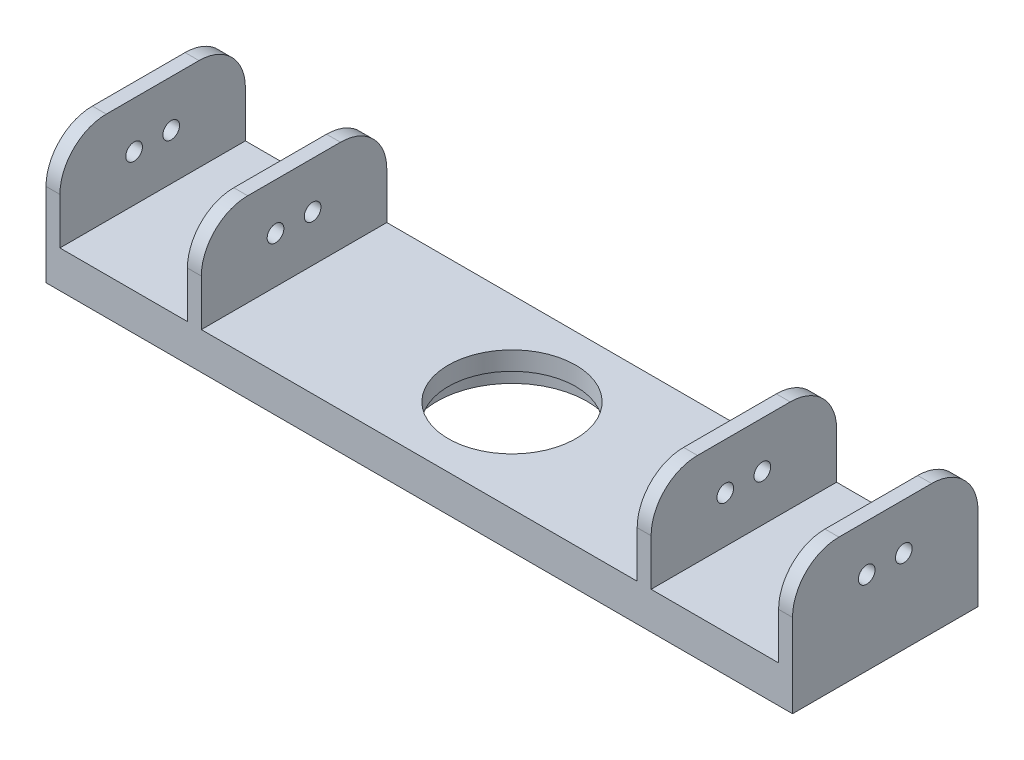
ISO-10303-21;
HEADER;
FILE_DESCRIPTION(('STEP AP214'),'2;1');
FILE_NAME('part.step','',(''),(''),'','','');
FILE_SCHEMA(('AUTOMOTIVE_DESIGN { 1 0 10303 214 1 1 1 1 }'));
ENDSEC;
DATA;
#1=APPLICATION_CONTEXT('core data for automotive mechanical design processes');
#2=APPLICATION_PROTOCOL_DEFINITION('international standard','automotive_design',2000,#1);
#3=PRODUCT_CONTEXT('',#1,'mechanical');
#4=PRODUCT('Part','Part','',(#3));
#5=PRODUCT_RELATED_PRODUCT_CATEGORY('part','',(#4));
#6=PRODUCT_DEFINITION_FORMATION('','',#4);
#7=PRODUCT_DEFINITION_CONTEXT('part definition',#1,'design');
#8=PRODUCT_DEFINITION('design','',#6,#7);
#9=PRODUCT_DEFINITION_SHAPE('','',#8);
#10=(LENGTH_UNIT() NAMED_UNIT(*) SI_UNIT(.MILLI.,.METRE.));
#11=(NAMED_UNIT(*) PLANE_ANGLE_UNIT() SI_UNIT($,.RADIAN.));
#12=(NAMED_UNIT(*) SI_UNIT($,.STERADIAN.) SOLID_ANGLE_UNIT());
#13=UNCERTAINTY_MEASURE_WITH_UNIT(LENGTH_MEASURE(1.E-05),#10,'distance_accuracy_value','');
#14=(GEOMETRIC_REPRESENTATION_CONTEXT(3) GLOBAL_UNCERTAINTY_ASSIGNED_CONTEXT((#13)) GLOBAL_UNIT_ASSIGNED_CONTEXT((#10,
#11,#12)) REPRESENTATION_CONTEXT('',''));
#15=CARTESIAN_POINT('',(0.,0.,0.));
#16=DIRECTION('',(0.,0.,1.));
#17=DIRECTION('',(1.,0.,0.));
#18=AXIS2_PLACEMENT_3D('',#15,#16,#17);
#19=CARTESIAN_POINT('',(0.,8.,0.));
#20=DIRECTION('',(0.,-1.,0.));
#21=DIRECTION('',(0.,0.,-1.));
#22=AXIS2_PLACEMENT_3D('',#19,#20,#21);
#23=PLANE('',#22);
#24=DIRECTION('',(0.,0.,-1.));
#25=VECTOR('',#24,1.);
#26=CARTESIAN_POINT('',(50.,8.,-20.));
#27=LINE('',#26,#25);
#28=CARTESIAN_POINT('',(50.,8.,20.));
#29=VERTEX_POINT('',#28);
#30=CARTESIAN_POINT('',(50.,8.,-20.));
#31=VERTEX_POINT('',#30);
#32=EDGE_CURVE('E199',#29,#31,#27,.T.);
#33=ORIENTED_EDGE('',*,*,#32,.F.);
#34=DIRECTION('',(1.,0.,0.));
#35=VECTOR('',#34,1.);
#36=CARTESIAN_POINT('',(-80.5,8.,20.));
#37=LINE('',#36,#35);
#38=CARTESIAN_POINT('',(77.5,8.,20.));
#39=VERTEX_POINT('',#38);
#40=EDGE_CURVE('E208',#29,#39,#37,.T.);
#41=ORIENTED_EDGE('',*,*,#40,.T.);
#42=DIRECTION('',(0.,0.,1.));
#43=VECTOR('',#42,1.);
#44=CARTESIAN_POINT('',(77.5,8.,-20.));
#45=LINE('',#44,#43);
#46=CARTESIAN_POINT('',(77.5,8.,-20.));
#47=VERTEX_POINT('',#46);
#48=EDGE_CURVE('E238',#47,#39,#45,.T.);
#49=ORIENTED_EDGE('',*,*,#48,.F.);
#50=DIRECTION('',(-1.,0.,0.));
#51=VECTOR('',#50,1.);
#52=CARTESIAN_POINT('',(-80.5,8.,-20.));
#53=LINE('',#52,#51);
#54=EDGE_CURVE('E216',#47,#31,#53,.T.);
#55=ORIENTED_EDGE('',*,*,#54,.T.);
#56=EDGE_LOOP('',(#33,#41,#49,#55));
#57=FACE_BOUND('',#56,.T.);
#58=ADVANCED_FACE('F33',(#57),#23,.F.);
#59=CARTESIAN_POINT('',(0.,8.,0.));
#60=DIRECTION('',(0.,-1.,0.));
#61=DIRECTION('',(0.,0.,-1.));
#62=AXIS2_PLACEMENT_3D('',#59,#60,#61);
#63=CIRCLE('',#62,13.75);
#64=CARTESIAN_POINT('',(0.,8.,-13.75));
#65=VERTEX_POINT('',#64);
#66=EDGE_CURVE('E898',#65,#65,#63,.F.);
#67=ORIENTED_EDGE('',*,*,#66,.F.);
#68=EDGE_LOOP('',(#67));
#69=FACE_BOUND('',#68,.T.);
#70=DIRECTION('',(0.,0.,1.));
#71=VECTOR('',#70,1.);
#72=CARTESIAN_POINT('',(47.,8.,-20.));
#73=LINE('',#72,#71);
#74=CARTESIAN_POINT('',(47.,8.,-20.));
#75=VERTEX_POINT('',#74);
#76=CARTESIAN_POINT('',(47.,8.,20.));
#77=VERTEX_POINT('',#76);
#78=EDGE_CURVE('E221',#75,#77,#73,.T.);
#79=ORIENTED_EDGE('',*,*,#78,.F.);
#80=CARTESIAN_POINT('',(-47.,8.,-20.));
#81=VERTEX_POINT('',#80);
#82=EDGE_CURVE('E282',#75,#81,#53,.T.);
#83=ORIENTED_EDGE('',*,*,#82,.T.);
#84=DIRECTION('',(0.,0.,-1.));
#85=VECTOR('',#84,1.);
#86=CARTESIAN_POINT('',(-47.,8.,-20.));
#87=LINE('',#86,#85);
#88=CARTESIAN_POINT('',(-47.,8.,20.));
#89=VERTEX_POINT('',#88);
#90=EDGE_CURVE('E266',#89,#81,#87,.T.);
#91=ORIENTED_EDGE('',*,*,#90,.F.);
#92=EDGE_CURVE('E215',#89,#77,#37,.T.);
#93=ORIENTED_EDGE('',*,*,#92,.T.);
#94=EDGE_LOOP('',(#79,#83,#91,#93));
#95=FACE_BOUND('',#94,.T.);
#96=ADVANCED_FACE('F436',(#69,#95),#23,.F.);
#97=DIRECTION('',(0.,0.,-1.));
#98=VECTOR('',#97,1.);
#99=CARTESIAN_POINT('',(-77.5,8.,-20.));
#100=LINE('',#99,#98);
#101=CARTESIAN_POINT('',(-77.5,8.,20.));
#102=VERTEX_POINT('',#101);
#103=CARTESIAN_POINT('',(-77.5,8.,-20.));
#104=VERTEX_POINT('',#103);
#105=EDGE_CURVE('E248',#102,#104,#100,.T.);
#106=ORIENTED_EDGE('',*,*,#105,.F.);
#107=CARTESIAN_POINT('',(-50.,8.,20.));
#108=VERTEX_POINT('',#107);
#109=EDGE_CURVE('E218',#102,#108,#37,.T.);
#110=ORIENTED_EDGE('',*,*,#109,.T.);
#111=DIRECTION('',(0.,0.,1.));
#112=VECTOR('',#111,1.);
#113=CARTESIAN_POINT('',(-50.,8.,-20.));
#114=LINE('',#113,#112);
#115=CARTESIAN_POINT('',(-50.,8.,-20.));
#116=VERTEX_POINT('',#115);
#117=EDGE_CURVE('E261',#116,#108,#114,.T.);
#118=ORIENTED_EDGE('',*,*,#117,.F.);
#119=EDGE_CURVE('E283',#116,#104,#53,.T.);
#120=ORIENTED_EDGE('',*,*,#119,.T.);
#121=EDGE_LOOP('',(#106,#110,#118,#120));
#122=FACE_BOUND('',#121,.T.);
#123=ADVANCED_FACE('F429',(#122),#23,.F.);
#124=CARTESIAN_POINT('',(80.5,8.,20.));
#125=DIRECTION('',(-1.,0.,0.));
#126=DIRECTION('',(0.,0.,1.));
#127=AXIS2_PLACEMENT_3D('',#124,#125,#126);
#128=PLANE('',#127);
#129=CARTESIAN_POINT('',(80.5,18.,4.));
#130=DIRECTION('',(-1.,0.,0.));
#131=DIRECTION('',(0.,0.,1.));
#132=AXIS2_PLACEMENT_3D('',#129,#130,#131);
#133=CIRCLE('',#132,1.8);
#134=CARTESIAN_POINT('',(80.5,18.,5.8));
#135=VERTEX_POINT('',#134);
#136=EDGE_CURVE('E310',#135,#135,#133,.T.);
#137=ORIENTED_EDGE('',*,*,#136,.T.);
#138=EDGE_LOOP('',(#137));
#139=FACE_BOUND('',#138,.T.);
#140=CARTESIAN_POINT('',(80.5,18.,-4.));
#141=DIRECTION('',(-1.,0.,0.));
#142=DIRECTION('',(0.,0.,1.));
#143=AXIS2_PLACEMENT_3D('',#140,#141,#142);
#144=CIRCLE('',#143,1.8);
#145=CARTESIAN_POINT('',(80.5,18.,-2.2));
#146=VERTEX_POINT('',#145);
#147=EDGE_CURVE('E849',#146,#146,#144,.T.);
#148=ORIENTED_EDGE('',*,*,#147,.T.);
#149=EDGE_LOOP('',(#148));
#150=FACE_BOUND('',#149,.T.);
#151=DIRECTION('',(0.,0.,-1.));
#152=VECTOR('',#151,1.);
#153=CARTESIAN_POINT('',(80.5,28.,-20.));
#154=LINE('',#153,#152);
#155=CARTESIAN_POINT('',(80.5,28.,9.99999999999999));
#156=VERTEX_POINT('',#155);
#157=CARTESIAN_POINT('',(80.5,28.,-10.));
#158=VERTEX_POINT('',#157);
#159=EDGE_CURVE('E239',#156,#158,#154,.T.);
#160=ORIENTED_EDGE('',*,*,#159,.F.);
#161=CARTESIAN_POINT('',(80.5,18.,10.));
#162=DIRECTION('',(-1.,0.,0.));
#163=DIRECTION('',(0.,0.,1.));
#164=AXIS2_PLACEMENT_3D('',#161,#162,#163);
#165=CIRCLE('',#164,10.);
#166=CARTESIAN_POINT('',(80.5,18.,20.));
#167=VERTEX_POINT('',#166);
#168=EDGE_CURVE('E379',#156,#167,#165,.F.);
#169=ORIENTED_EDGE('',*,*,#168,.T.);
#170=DIRECTION('',(0.,-1.,0.));
#171=VECTOR('',#170,1.);
#172=CARTESIAN_POINT('',(80.5,8.,20.));
#173=LINE('',#172,#171);
#174=CARTESIAN_POINT('',(80.5,0.,20.));
#175=VERTEX_POINT('',#174);
#176=EDGE_CURVE('E286',#167,#175,#173,.T.);
#177=ORIENTED_EDGE('',*,*,#176,.T.);
#178=DIRECTION('',(0.,0.,-1.));
#179=VECTOR('',#178,1.);
#180=CARTESIAN_POINT('',(80.5,0.,20.));
#181=LINE('',#180,#179);
#182=CARTESIAN_POINT('',(80.5,0.,-20.));
#183=VERTEX_POINT('',#182);
#184=EDGE_CURVE('E281',#175,#183,#181,.T.);
#185=ORIENTED_EDGE('',*,*,#184,.T.);
#186=DIRECTION('',(0.,-1.,0.));
#187=VECTOR('',#186,1.);
#188=CARTESIAN_POINT('',(80.5,8.,-20.));
#189=LINE('',#188,#187);
#190=CARTESIAN_POINT('',(80.5,18.,-20.));
#191=VERTEX_POINT('',#190);
#192=EDGE_CURVE('E303',#191,#183,#189,.T.);
#193=ORIENTED_EDGE('',*,*,#192,.F.);
#194=CARTESIAN_POINT('',(80.5,18.,-10.));
#195=DIRECTION('',(-1.,0.,0.));
#196=DIRECTION('',(0.,0.,1.));
#197=AXIS2_PLACEMENT_3D('',#194,#195,#196);
#198=CIRCLE('',#197,10.);
#199=EDGE_CURVE('E377',#191,#158,#198,.F.);
#200=ORIENTED_EDGE('',*,*,#199,.T.);
#201=EDGE_LOOP('',(#160,#169,#177,#185,#193,#200));
#202=FACE_BOUND('',#201,.T.);
#203=ADVANCED_FACE('F389',(#139,#150,#202),#128,.F.);
#204=CARTESIAN_POINT('',(-80.5,8.,-20.));
#205=DIRECTION('',(0.,0.,1.));
#206=DIRECTION('',(1.,0.,0.));
#207=AXIS2_PLACEMENT_3D('',#204,#205,#206);
#208=PLANE('',#207);
#209=DIRECTION('',(0.,-1.,0.));
#210=VECTOR('',#209,1.);
#211=CARTESIAN_POINT('',(-50.,28.,-20.));
#212=LINE('',#211,#210);
#213=CARTESIAN_POINT('',(-50.,18.,-20.));
#214=VERTEX_POINT('',#213);
#215=EDGE_CURVE('E269',#214,#116,#212,.T.);
#216=ORIENTED_EDGE('',*,*,#215,.F.);
#217=DIRECTION('',(-1.,0.,0.));
#218=VECTOR('',#217,1.);
#219=CARTESIAN_POINT('',(-47.,18.,-20.));
#220=LINE('',#219,#218);
#221=CARTESIAN_POINT('',(-47.,18.,-20.));
#222=VERTEX_POINT('',#221);
#223=EDGE_CURVE('E331',#214,#222,#220,.F.);
#224=ORIENTED_EDGE('',*,*,#223,.T.);
#225=DIRECTION('',(0.,-1.,0.));
#226=VECTOR('',#225,1.);
#227=CARTESIAN_POINT('',(-47.,28.,-20.));
#228=LINE('',#227,#226);
#229=EDGE_CURVE('E275',#222,#81,#228,.T.);
#230=ORIENTED_EDGE('',*,*,#229,.T.);
#231=ORIENTED_EDGE('',*,*,#82,.F.);
#232=DIRECTION('',(0.,-1.,0.));
#233=VECTOR('',#232,1.);
#234=CARTESIAN_POINT('',(47.,28.,-20.));
#235=LINE('',#234,#233);
#236=CARTESIAN_POINT('',(47.,18.,-20.));
#237=VERTEX_POINT('',#236);
#238=EDGE_CURVE('E234',#237,#75,#235,.T.);
#239=ORIENTED_EDGE('',*,*,#238,.F.);
#240=DIRECTION('',(-1.,0.,0.));
#241=VECTOR('',#240,1.);
#242=CARTESIAN_POINT('',(-80.5,18.,-20.));
#243=LINE('',#242,#241);
#244=CARTESIAN_POINT('',(50.,18.,-20.));
#245=VERTEX_POINT('',#244);
#246=EDGE_CURVE('E327',#237,#245,#243,.F.);
#247=ORIENTED_EDGE('',*,*,#246,.T.);
#248=DIRECTION('',(0.,-1.,0.));
#249=VECTOR('',#248,1.);
#250=CARTESIAN_POINT('',(50.,28.,-20.));
#251=LINE('',#250,#249);
#252=EDGE_CURVE('E236',#245,#31,#251,.T.);
#253=ORIENTED_EDGE('',*,*,#252,.T.);
#254=ORIENTED_EDGE('',*,*,#54,.F.);
#255=DIRECTION('',(0.,-1.,0.));
#256=VECTOR('',#255,1.);
#257=CARTESIAN_POINT('',(77.5,28.,-20.));
#258=LINE('',#257,#256);
#259=CARTESIAN_POINT('',(77.5,18.,-20.));
#260=VERTEX_POINT('',#259);
#261=EDGE_CURVE('E246',#260,#47,#258,.T.);
#262=ORIENTED_EDGE('',*,*,#261,.F.);
#263=DIRECTION('',(-1.,0.,0.));
#264=VECTOR('',#263,1.);
#265=CARTESIAN_POINT('',(-80.5,18.,-20.));
#266=LINE('',#265,#264);
#267=EDGE_CURVE('E325',#260,#191,#266,.F.);
#268=ORIENTED_EDGE('',*,*,#267,.T.);
#269=ORIENTED_EDGE('',*,*,#192,.T.);
#270=DIRECTION('',(-1.,0.,0.));
#271=VECTOR('',#270,1.);
#272=CARTESIAN_POINT('',(-80.5,0.,-20.));
#273=LINE('',#272,#271);
#274=CARTESIAN_POINT('',(-80.5,0.,-20.));
#275=VERTEX_POINT('',#274);
#276=EDGE_CURVE('E289',#183,#275,#273,.T.);
#277=ORIENTED_EDGE('',*,*,#276,.T.);
#278=DIRECTION('',(0.,-1.,0.));
#279=VECTOR('',#278,1.);
#280=CARTESIAN_POINT('',(-80.5,8.,-20.));
#281=LINE('',#280,#279);
#282=CARTESIAN_POINT('',(-80.5,18.,-20.));
#283=VERTEX_POINT('',#282);
#284=EDGE_CURVE('E301',#283,#275,#281,.T.);
#285=ORIENTED_EDGE('',*,*,#284,.F.);
#286=DIRECTION('',(-1.,0.,0.));
#287=VECTOR('',#286,1.);
#288=CARTESIAN_POINT('',(-77.5,18.,-20.));
#289=LINE('',#288,#287);
#290=CARTESIAN_POINT('',(-77.5,18.,-20.));
#291=VERTEX_POINT('',#290);
#292=EDGE_CURVE('E329',#283,#291,#289,.F.);
#293=ORIENTED_EDGE('',*,*,#292,.T.);
#294=DIRECTION('',(0.,-1.,0.));
#295=VECTOR('',#294,1.);
#296=CARTESIAN_POINT('',(-77.5,28.,-20.));
#297=LINE('',#296,#295);
#298=EDGE_CURVE('E255',#291,#104,#297,.T.);
#299=ORIENTED_EDGE('',*,*,#298,.T.);
#300=ORIENTED_EDGE('',*,*,#119,.F.);
#301=EDGE_LOOP('',(#216,#224,#230,#231,#239,#247,#253,#254,#262,#268,#269,#277,#285,#293,#299,#300));
#302=FACE_BOUND('',#301,.T.);
#303=ADVANCED_FACE('F384',(#302),#208,.F.);
#304=CARTESIAN_POINT('',(-80.5,8.,20.));
#305=DIRECTION('',(1.,0.,0.));
#306=DIRECTION('',(0.,0.,-1.));
#307=AXIS2_PLACEMENT_3D('',#304,#305,#306);
#308=PLANE('',#307);
#309=CARTESIAN_POINT('',(-80.5,18.,4.));
#310=DIRECTION('',(1.,0.,0.));
#311=DIRECTION('',(0.,0.,-1.));
#312=AXIS2_PLACEMENT_3D('',#309,#310,#311);
#313=CIRCLE('',#312,1.8);
#314=CARTESIAN_POINT('',(-80.5,18.,2.2));
#315=VERTEX_POINT('',#314);
#316=EDGE_CURVE('E506',#315,#315,#313,.T.);
#317=ORIENTED_EDGE('',*,*,#316,.T.);
#318=EDGE_LOOP('',(#317));
#319=FACE_BOUND('',#318,.T.);
#320=CARTESIAN_POINT('',(-80.5,18.,-4.));
#321=DIRECTION('',(1.,0.,0.));
#322=DIRECTION('',(0.,0.,-1.));
#323=AXIS2_PLACEMENT_3D('',#320,#321,#322);
#324=CIRCLE('',#323,1.8);
#325=CARTESIAN_POINT('',(-80.5,18.,-5.8));
#326=VERTEX_POINT('',#325);
#327=EDGE_CURVE('E315',#326,#326,#324,.T.);
#328=ORIENTED_EDGE('',*,*,#327,.T.);
#329=EDGE_LOOP('',(#328));
#330=FACE_BOUND('',#329,.T.);
#331=DIRECTION('',(0.,0.,1.));
#332=VECTOR('',#331,1.);
#333=CARTESIAN_POINT('',(-80.5,28.,-20.));
#334=LINE('',#333,#332);
#335=CARTESIAN_POINT('',(-80.5,28.,-10.));
#336=VERTEX_POINT('',#335);
#337=CARTESIAN_POINT('',(-80.5,28.,9.99999999999999));
#338=VERTEX_POINT('',#337);
#339=EDGE_CURVE('E249',#336,#338,#334,.T.);
#340=ORIENTED_EDGE('',*,*,#339,.F.);
#341=CARTESIAN_POINT('',(-80.5,18.,-10.));
#342=DIRECTION('',(1.,0.,0.));
#343=DIRECTION('',(0.,0.,-1.));
#344=AXIS2_PLACEMENT_3D('',#341,#342,#343);
#345=CIRCLE('',#344,10.);
#346=EDGE_CURVE('E345',#336,#283,#345,.F.);
#347=ORIENTED_EDGE('',*,*,#346,.T.);
#348=ORIENTED_EDGE('',*,*,#284,.T.);
#349=DIRECTION('',(0.,0.,1.));
#350=VECTOR('',#349,1.);
#351=CARTESIAN_POINT('',(-80.5,0.,20.));
#352=LINE('',#351,#350);
#353=CARTESIAN_POINT('',(-80.5,0.,20.));
#354=VERTEX_POINT('',#353);
#355=EDGE_CURVE('E292',#275,#354,#352,.T.);
#356=ORIENTED_EDGE('',*,*,#355,.T.);
#357=DIRECTION('',(0.,-1.,0.));
#358=VECTOR('',#357,1.);
#359=CARTESIAN_POINT('',(-80.5,8.,20.));
#360=LINE('',#359,#358);
#361=CARTESIAN_POINT('',(-80.5,18.,20.));
#362=VERTEX_POINT('',#361);
#363=EDGE_CURVE('E299',#362,#354,#360,.T.);
#364=ORIENTED_EDGE('',*,*,#363,.F.);
#365=CARTESIAN_POINT('',(-80.5,18.,10.));
#366=DIRECTION('',(1.,0.,0.));
#367=DIRECTION('',(0.,0.,-1.));
#368=AXIS2_PLACEMENT_3D('',#365,#366,#367);
#369=CIRCLE('',#368,10.);
#370=EDGE_CURVE('E343',#362,#338,#369,.F.);
#371=ORIENTED_EDGE('',*,*,#370,.T.);
#372=EDGE_LOOP('',(#340,#347,#348,#356,#364,#371));
#373=FACE_BOUND('',#372,.T.);
#374=ADVANCED_FACE('F488',(#319,#330,#373),#308,.F.);
#375=CARTESIAN_POINT('',(-80.5,8.,20.));
#376=DIRECTION('',(0.,0.,-1.));
#377=DIRECTION('',(-1.,0.,0.));
#378=AXIS2_PLACEMENT_3D('',#375,#376,#377);
#379=PLANE('',#378);
#380=DIRECTION('',(0.,-1.,0.));
#381=VECTOR('',#380,1.);
#382=CARTESIAN_POINT('',(-77.5,28.,20.));
#383=LINE('',#382,#381);
#384=CARTESIAN_POINT('',(-77.5,18.,20.));
#385=VERTEX_POINT('',#384);
#386=EDGE_CURVE('E259',#385,#102,#383,.T.);
#387=ORIENTED_EDGE('',*,*,#386,.F.);
#388=DIRECTION('',(1.,0.,0.));
#389=VECTOR('',#388,1.);
#390=CARTESIAN_POINT('',(-80.5,18.,20.));
#391=LINE('',#390,#389);
#392=EDGE_CURVE('E357',#385,#362,#391,.F.);
#393=ORIENTED_EDGE('',*,*,#392,.T.);
#394=ORIENTED_EDGE('',*,*,#363,.T.);
#395=DIRECTION('',(1.,0.,0.));
#396=VECTOR('',#395,1.);
#397=CARTESIAN_POINT('',(-80.5,0.,20.));
#398=LINE('',#397,#396);
#399=EDGE_CURVE('E295',#354,#175,#398,.T.);
#400=ORIENTED_EDGE('',*,*,#399,.T.);
#401=ORIENTED_EDGE('',*,*,#176,.F.);
#402=DIRECTION('',(1.,0.,0.));
#403=VECTOR('',#402,1.);
#404=CARTESIAN_POINT('',(-80.5,18.,20.));
#405=LINE('',#404,#403);
#406=CARTESIAN_POINT('',(77.5,18.,20.));
#407=VERTEX_POINT('',#406);
#408=EDGE_CURVE('E351',#167,#407,#405,.F.);
#409=ORIENTED_EDGE('',*,*,#408,.T.);
#410=DIRECTION('',(0.,-1.,0.));
#411=VECTOR('',#410,1.);
#412=CARTESIAN_POINT('',(77.5,28.,20.));
#413=LINE('',#412,#411);
#414=EDGE_CURVE('E211',#407,#39,#413,.T.);
#415=ORIENTED_EDGE('',*,*,#414,.T.);
#416=ORIENTED_EDGE('',*,*,#40,.F.);
#417=DIRECTION('',(0.,-1.,0.));
#418=VECTOR('',#417,1.);
#419=CARTESIAN_POINT('',(50.,28.,20.));
#420=LINE('',#419,#418);
#421=CARTESIAN_POINT('',(50.,18.,20.));
#422=VERTEX_POINT('',#421);
#423=EDGE_CURVE('E194',#422,#29,#420,.T.);
#424=ORIENTED_EDGE('',*,*,#423,.F.);
#425=DIRECTION('',(1.,0.,0.));
#426=VECTOR('',#425,1.);
#427=CARTESIAN_POINT('',(-80.5,18.,20.));
#428=LINE('',#427,#426);
#429=CARTESIAN_POINT('',(47.,18.,20.));
#430=VERTEX_POINT('',#429);
#431=EDGE_CURVE('E353',#422,#430,#428,.F.);
#432=ORIENTED_EDGE('',*,*,#431,.T.);
#433=DIRECTION('',(0.,-1.,0.));
#434=VECTOR('',#433,1.);
#435=CARTESIAN_POINT('',(47.,28.,20.));
#436=LINE('',#435,#434);
#437=EDGE_CURVE('E204',#430,#77,#436,.T.);
#438=ORIENTED_EDGE('',*,*,#437,.T.);
#439=ORIENTED_EDGE('',*,*,#92,.F.);
#440=DIRECTION('',(0.,-1.,0.));
#441=VECTOR('',#440,1.);
#442=CARTESIAN_POINT('',(-47.,28.,20.));
#443=LINE('',#442,#441);
#444=CARTESIAN_POINT('',(-47.,18.,20.));
#445=VERTEX_POINT('',#444);
#446=EDGE_CURVE('E277',#445,#89,#443,.T.);
#447=ORIENTED_EDGE('',*,*,#446,.F.);
#448=DIRECTION('',(1.,0.,0.));
#449=VECTOR('',#448,1.);
#450=CARTESIAN_POINT('',(-50.,18.,20.));
#451=LINE('',#450,#449);
#452=CARTESIAN_POINT('',(-50.,18.,20.));
#453=VERTEX_POINT('',#452);
#454=EDGE_CURVE('E355',#445,#453,#451,.F.);
#455=ORIENTED_EDGE('',*,*,#454,.T.);
#456=DIRECTION('',(0.,-1.,0.));
#457=VECTOR('',#456,1.);
#458=CARTESIAN_POINT('',(-50.,28.,20.));
#459=LINE('',#458,#457);
#460=EDGE_CURVE('E279',#453,#108,#459,.T.);
#461=ORIENTED_EDGE('',*,*,#460,.T.);
#462=ORIENTED_EDGE('',*,*,#109,.F.);
#463=EDGE_LOOP('',(#387,#393,#394,#400,#401,#409,#415,#416,#424,#432,#438,#439,#447,#455,#461,#462));
#464=FACE_BOUND('',#463,.T.);
#465=ADVANCED_FACE('F210',(#464),#379,.F.);
#466=CARTESIAN_POINT('',(0.,0.,0.));
#467=DIRECTION('',(0.,-1.,0.));
#468=DIRECTION('',(0.,0.,-1.));
#469=AXIS2_PLACEMENT_3D('',#466,#467,#468);
#470=PLANE('',#469);
#471=CARTESIAN_POINT('',(0.,0.,0.));
#472=DIRECTION('',(0.,-1.,0.));
#473=DIRECTION('',(0.,0.,-1.));
#474=AXIS2_PLACEMENT_3D('',#471,#472,#473);
#475=CIRCLE('',#474,16.2);
#476=CARTESIAN_POINT('',(0.,0.,-16.2));
#477=VERTEX_POINT('',#476);
#478=EDGE_CURVE('E228',#477,#477,#475,.T.);
#479=ORIENTED_EDGE('',*,*,#478,.F.);
#480=EDGE_LOOP('',(#479));
#481=FACE_BOUND('',#480,.T.);
#482=ORIENTED_EDGE('',*,*,#184,.F.);
#483=ORIENTED_EDGE('',*,*,#399,.F.);
#484=ORIENTED_EDGE('',*,*,#355,.F.);
#485=ORIENTED_EDGE('',*,*,#276,.F.);
#486=EDGE_LOOP('',(#482,#483,#484,#485));
#487=FACE_BOUND('',#486,.T.);
#488=ADVANCED_FACE('F403',(#481,#487),#470,.T.);
#489=CARTESIAN_POINT('',(-50.,28.,-20.));
#490=DIRECTION('',(1.,0.,0.));
#491=DIRECTION('',(0.,0.,-1.));
#492=AXIS2_PLACEMENT_3D('',#489,#490,#491);
#493=PLANE('',#492);
#494=CARTESIAN_POINT('',(-50.,18.,4.));
#495=DIRECTION('',(1.,0.,0.));
#496=DIRECTION('',(0.,0.,-1.));
#497=AXIS2_PLACEMENT_3D('',#494,#495,#496);
#498=CIRCLE('',#497,1.8);
#499=CARTESIAN_POINT('',(-50.,18.,2.2));
#500=VERTEX_POINT('',#499);
#501=EDGE_CURVE('E509',#500,#500,#498,.T.);
#502=ORIENTED_EDGE('',*,*,#501,.T.);
#503=EDGE_LOOP('',(#502));
#504=FACE_BOUND('',#503,.T.);
#505=CARTESIAN_POINT('',(-50.,18.,-4.));
#506=DIRECTION('',(1.,0.,0.));
#507=DIRECTION('',(0.,0.,-1.));
#508=AXIS2_PLACEMENT_3D('',#505,#506,#507);
#509=CIRCLE('',#508,1.8);
#510=CARTESIAN_POINT('',(-50.,18.,-5.8));
#511=VERTEX_POINT('',#510);
#512=EDGE_CURVE('E857',#511,#511,#509,.T.);
#513=ORIENTED_EDGE('',*,*,#512,.T.);
#514=EDGE_LOOP('',(#513));
#515=FACE_BOUND('',#514,.T.);
#516=DIRECTION('',(0.,0.,1.));
#517=VECTOR('',#516,1.);
#518=CARTESIAN_POINT('',(-50.,28.,-20.));
#519=LINE('',#518,#517);
#520=CARTESIAN_POINT('',(-50.,28.,-10.));
#521=VERTEX_POINT('',#520);
#522=CARTESIAN_POINT('',(-50.,28.,9.99999999999999));
#523=VERTEX_POINT('',#522);
#524=EDGE_CURVE('E262',#521,#523,#519,.T.);
#525=ORIENTED_EDGE('',*,*,#524,.F.);
#526=CARTESIAN_POINT('',(-50.,18.,-10.));
#527=DIRECTION('',(1.,0.,0.));
#528=DIRECTION('',(0.,0.,-1.));
#529=AXIS2_PLACEMENT_3D('',#526,#527,#528);
#530=CIRCLE('',#529,10.);
#531=EDGE_CURVE('E323',#521,#214,#530,.F.);
#532=ORIENTED_EDGE('',*,*,#531,.T.);
#533=ORIENTED_EDGE('',*,*,#215,.T.);
#534=ORIENTED_EDGE('',*,*,#117,.T.);
#535=ORIENTED_EDGE('',*,*,#460,.F.);
#536=CARTESIAN_POINT('',(-50.,18.,10.));
#537=DIRECTION('',(1.,0.,0.));
#538=DIRECTION('',(0.,0.,-1.));
#539=AXIS2_PLACEMENT_3D('',#536,#537,#538);
#540=CIRCLE('',#539,10.);
#541=EDGE_CURVE('E321',#453,#523,#540,.F.);
#542=ORIENTED_EDGE('',*,*,#541,.T.);
#543=EDGE_LOOP('',(#525,#532,#533,#534,#535,#542));
#544=FACE_BOUND('',#543,.T.);
#545=ADVANCED_FACE('F453',(#504,#515,#544),#493,.F.);
#546=CARTESIAN_POINT('',(-47.,28.,-20.));
#547=DIRECTION('',(-1.,0.,0.));
#548=DIRECTION('',(0.,0.,1.));
#549=AXIS2_PLACEMENT_3D('',#546,#547,#548);
#550=PLANE('',#549);
#551=CARTESIAN_POINT('',(-47.,18.,4.));
#552=DIRECTION('',(-1.,0.,0.));
#553=DIRECTION('',(0.,0.,1.));
#554=AXIS2_PLACEMENT_3D('',#551,#552,#553);
#555=CIRCLE('',#554,1.8);
#556=CARTESIAN_POINT('',(-47.,18.,5.8));
#557=VERTEX_POINT('',#556);
#558=EDGE_CURVE('E870',#557,#557,#555,.T.);
#559=ORIENTED_EDGE('',*,*,#558,.T.);
#560=EDGE_LOOP('',(#559));
#561=FACE_BOUND('',#560,.T.);
#562=CARTESIAN_POINT('',(-47.,18.,-4.));
#563=DIRECTION('',(-1.,0.,0.));
#564=DIRECTION('',(0.,0.,1.));
#565=AXIS2_PLACEMENT_3D('',#562,#563,#564);
#566=CIRCLE('',#565,1.8);
#567=CARTESIAN_POINT('',(-47.,18.,-2.2));
#568=VERTEX_POINT('',#567);
#569=EDGE_CURVE('E854',#568,#568,#566,.T.);
#570=ORIENTED_EDGE('',*,*,#569,.T.);
#571=EDGE_LOOP('',(#570));
#572=FACE_BOUND('',#571,.T.);
#573=ORIENTED_EDGE('',*,*,#229,.F.);
#574=CARTESIAN_POINT('',(-47.,18.,-10.));
#575=DIRECTION('',(-1.,0.,0.));
#576=DIRECTION('',(0.,0.,1.));
#577=AXIS2_PLACEMENT_3D('',#574,#575,#576);
#578=CIRCLE('',#577,10.);
#579=CARTESIAN_POINT('',(-47.,28.,-10.));
#580=VERTEX_POINT('',#579);
#581=EDGE_CURVE('E335',#222,#580,#578,.F.);
#582=ORIENTED_EDGE('',*,*,#581,.T.);
#583=DIRECTION('',(0.,0.,-1.));
#584=VECTOR('',#583,1.);
#585=CARTESIAN_POINT('',(-47.,28.,-20.));
#586=LINE('',#585,#584);
#587=CARTESIAN_POINT('',(-47.,28.,9.99999999999999));
#588=VERTEX_POINT('',#587);
#589=EDGE_CURVE('E265',#588,#580,#586,.T.);
#590=ORIENTED_EDGE('',*,*,#589,.F.);
#591=CARTESIAN_POINT('',(-47.,18.,10.));
#592=DIRECTION('',(-1.,0.,0.));
#593=DIRECTION('',(0.,0.,1.));
#594=AXIS2_PLACEMENT_3D('',#591,#592,#593);
#595=CIRCLE('',#594,10.);
#596=EDGE_CURVE('E333',#588,#445,#595,.F.);
#597=ORIENTED_EDGE('',*,*,#596,.T.);
#598=ORIENTED_EDGE('',*,*,#446,.T.);
#599=ORIENTED_EDGE('',*,*,#90,.T.);
#600=EDGE_LOOP('',(#573,#582,#590,#597,#598,#599));
#601=FACE_BOUND('',#600,.T.);
#602=ADVANCED_FACE('F442',(#561,#572,#601),#550,.F.);
#603=CARTESIAN_POINT('',(0.,28.,0.));
#604=DIRECTION('',(0.,1.,0.));
#605=DIRECTION('',(0.,0.,1.));
#606=AXIS2_PLACEMENT_3D('',#603,#604,#605);
#607=PLANE('',#606);
#608=ORIENTED_EDGE('',*,*,#589,.T.);
#609=DIRECTION('',(-1.,0.,0.));
#610=VECTOR('',#609,1.);
#611=CARTESIAN_POINT('',(-50.,28.,-10.));
#612=LINE('',#611,#610);
#613=EDGE_CURVE('E318',#580,#521,#612,.T.);
#614=ORIENTED_EDGE('',*,*,#613,.T.);
#615=ORIENTED_EDGE('',*,*,#524,.T.);
#616=DIRECTION('',(1.,0.,0.));
#617=VECTOR('',#616,1.);
#618=CARTESIAN_POINT('',(-47.,28.,10.));
#619=LINE('',#618,#617);
#620=EDGE_CURVE('E305',#523,#588,#619,.T.);
#621=ORIENTED_EDGE('',*,*,#620,.T.);
#622=EDGE_LOOP('',(#608,#614,#615,#621));
#623=FACE_BOUND('',#622,.T.);
#624=ADVANCED_FACE('F455',(#623),#607,.T.);
#625=CARTESIAN_POINT('',(-77.5,28.,-20.));
#626=DIRECTION('',(-1.,0.,0.));
#627=DIRECTION('',(0.,0.,1.));
#628=AXIS2_PLACEMENT_3D('',#625,#626,#627);
#629=PLANE('',#628);
#630=CARTESIAN_POINT('',(-77.5,18.,4.));
#631=DIRECTION('',(-1.,0.,0.));
#632=DIRECTION('',(0.,0.,1.));
#633=AXIS2_PLACEMENT_3D('',#630,#631,#632);
#634=CIRCLE('',#633,1.8);
#635=CARTESIAN_POINT('',(-77.5,18.,5.8));
#636=VERTEX_POINT('',#635);
#637=EDGE_CURVE('E867',#636,#636,#634,.T.);
#638=ORIENTED_EDGE('',*,*,#637,.T.);
#639=EDGE_LOOP('',(#638));
#640=FACE_BOUND('',#639,.T.);
#641=CARTESIAN_POINT('',(-77.5,18.,-4.));
#642=DIRECTION('',(-1.,0.,0.));
#643=DIRECTION('',(0.,0.,1.));
#644=AXIS2_PLACEMENT_3D('',#641,#642,#643);
#645=CIRCLE('',#644,1.8);
#646=CARTESIAN_POINT('',(-77.5,18.,-2.2));
#647=VERTEX_POINT('',#646);
#648=EDGE_CURVE('E846',#647,#647,#645,.T.);
#649=ORIENTED_EDGE('',*,*,#648,.T.);
#650=EDGE_LOOP('',(#649));
#651=FACE_BOUND('',#650,.T.);
#652=ORIENTED_EDGE('',*,*,#298,.F.);
#653=CARTESIAN_POINT('',(-77.5,18.,-10.));
#654=DIRECTION('',(-1.,0.,0.));
#655=DIRECTION('',(0.,0.,1.));
#656=AXIS2_PLACEMENT_3D('',#653,#654,#655);
#657=CIRCLE('',#656,10.);
#658=CARTESIAN_POINT('',(-77.5,28.,-10.));
#659=VERTEX_POINT('',#658);
#660=EDGE_CURVE('E349',#291,#659,#657,.F.);
#661=ORIENTED_EDGE('',*,*,#660,.T.);
#662=DIRECTION('',(0.,0.,-1.));
#663=VECTOR('',#662,1.);
#664=CARTESIAN_POINT('',(-77.5,28.,-20.));
#665=LINE('',#664,#663);
#666=CARTESIAN_POINT('',(-77.5,28.,9.99999999999999));
#667=VERTEX_POINT('',#666);
#668=EDGE_CURVE('E252',#667,#659,#665,.T.);
#669=ORIENTED_EDGE('',*,*,#668,.F.);
#670=CARTESIAN_POINT('',(-77.5,18.,10.));
#671=DIRECTION('',(-1.,0.,0.));
#672=DIRECTION('',(0.,0.,1.));
#673=AXIS2_PLACEMENT_3D('',#670,#671,#672);
#674=CIRCLE('',#673,10.);
#675=EDGE_CURVE('E347',#667,#385,#674,.F.);
#676=ORIENTED_EDGE('',*,*,#675,.T.);
#677=ORIENTED_EDGE('',*,*,#386,.T.);
#678=ORIENTED_EDGE('',*,*,#105,.T.);
#679=EDGE_LOOP('',(#652,#661,#669,#676,#677,#678));
#680=FACE_BOUND('',#679,.T.);
#681=ADVANCED_FACE('F414',(#640,#651,#680),#629,.F.);
#682=CARTESIAN_POINT('',(0.,28.,0.));
#683=DIRECTION('',(0.,1.,0.));
#684=DIRECTION('',(0.,0.,1.));
#685=AXIS2_PLACEMENT_3D('',#682,#683,#684);
#686=PLANE('',#685);
#687=ORIENTED_EDGE('',*,*,#668,.T.);
#688=DIRECTION('',(-1.,0.,0.));
#689=VECTOR('',#688,1.);
#690=CARTESIAN_POINT('',(-80.5,28.,-10.));
#691=LINE('',#690,#689);
#692=EDGE_CURVE('E340',#659,#336,#691,.T.);
#693=ORIENTED_EDGE('',*,*,#692,.T.);
#694=ORIENTED_EDGE('',*,*,#339,.T.);
#695=DIRECTION('',(1.,0.,0.));
#696=VECTOR('',#695,1.);
#697=CARTESIAN_POINT('',(-77.5,28.,10.));
#698=LINE('',#697,#696);
#699=EDGE_CURVE('E337',#338,#667,#698,.T.);
#700=ORIENTED_EDGE('',*,*,#699,.T.);
#701=EDGE_LOOP('',(#687,#693,#694,#700));
#702=FACE_BOUND('',#701,.T.);
#703=ADVANCED_FACE('F416',(#702),#686,.T.);
#704=CARTESIAN_POINT('',(77.5,28.,-20.));
#705=DIRECTION('',(1.,0.,0.));
#706=DIRECTION('',(0.,0.,-1.));
#707=AXIS2_PLACEMENT_3D('',#704,#705,#706);
#708=PLANE('',#707);
#709=CARTESIAN_POINT('',(77.5,18.,4.));
#710=DIRECTION('',(1.,0.,0.));
#711=DIRECTION('',(0.,0.,-1.));
#712=AXIS2_PLACEMENT_3D('',#709,#710,#711);
#713=CIRCLE('',#712,1.8);
#714=CARTESIAN_POINT('',(77.5,18.,2.2));
#715=VERTEX_POINT('',#714);
#716=EDGE_CURVE('E864',#715,#715,#713,.T.);
#717=ORIENTED_EDGE('',*,*,#716,.T.);
#718=EDGE_LOOP('',(#717));
#719=FACE_BOUND('',#718,.T.);
#720=CARTESIAN_POINT('',(77.5,18.,-4.));
#721=DIRECTION('',(1.,0.,0.));
#722=DIRECTION('',(0.,0.,-1.));
#723=AXIS2_PLACEMENT_3D('',#720,#721,#722);
#724=CIRCLE('',#723,1.8);
#725=CARTESIAN_POINT('',(77.5,18.,-5.8));
#726=VERTEX_POINT('',#725);
#727=EDGE_CURVE('E843',#726,#726,#724,.T.);
#728=ORIENTED_EDGE('',*,*,#727,.T.);
#729=EDGE_LOOP('',(#728));
#730=FACE_BOUND('',#729,.T.);
#731=ORIENTED_EDGE('',*,*,#414,.F.);
#732=CARTESIAN_POINT('',(77.5,18.,10.));
#733=DIRECTION('',(1.,0.,0.));
#734=DIRECTION('',(0.,0.,-1.));
#735=AXIS2_PLACEMENT_3D('',#732,#733,#734);
#736=CIRCLE('',#735,10.);
#737=CARTESIAN_POINT('',(77.5,28.,9.99999999999999));
#738=VERTEX_POINT('',#737);
#739=EDGE_CURVE('E11',#407,#738,#736,.F.);
#740=ORIENTED_EDGE('',*,*,#739,.T.);
#741=DIRECTION('',(0.,0.,1.));
#742=VECTOR('',#741,1.);
#743=CARTESIAN_POINT('',(77.5,28.,-20.));
#744=LINE('',#743,#742);
#745=CARTESIAN_POINT('',(77.5,28.,-10.));
#746=VERTEX_POINT('',#745);
#747=EDGE_CURVE('E242',#746,#738,#744,.T.);
#748=ORIENTED_EDGE('',*,*,#747,.F.);
#749=CARTESIAN_POINT('',(77.5,18.,-10.));
#750=DIRECTION('',(1.,0.,0.));
#751=DIRECTION('',(0.,0.,-1.));
#752=AXIS2_PLACEMENT_3D('',#749,#750,#751);
#753=CIRCLE('',#752,10.);
#754=EDGE_CURVE('E41',#746,#260,#753,.F.);
#755=ORIENTED_EDGE('',*,*,#754,.T.);
#756=ORIENTED_EDGE('',*,*,#261,.T.);
#757=ORIENTED_EDGE('',*,*,#48,.T.);
#758=EDGE_LOOP('',(#731,#740,#748,#755,#756,#757));
#759=FACE_BOUND('',#758,.T.);
#760=ADVANCED_FACE('F381',(#719,#730,#759),#708,.F.);
#761=CARTESIAN_POINT('',(0.,28.,0.));
#762=DIRECTION('',(0.,-1.,0.));
#763=DIRECTION('',(0.,0.,-1.));
#764=AXIS2_PLACEMENT_3D('',#761,#762,#763);
#765=PLANE('',#764);
#766=ORIENTED_EDGE('',*,*,#747,.T.);
#767=DIRECTION('',(1.,0.,0.));
#768=VECTOR('',#767,1.);
#769=CARTESIAN_POINT('',(0.,28.,10.));
#770=LINE('',#769,#768);
#771=EDGE_CURVE('E374',#738,#156,#770,.T.);
#772=ORIENTED_EDGE('',*,*,#771,.T.);
#773=ORIENTED_EDGE('',*,*,#159,.T.);
#774=DIRECTION('',(-1.,0.,0.));
#775=VECTOR('',#774,1.);
#776=CARTESIAN_POINT('',(0.,28.,-10.));
#777=LINE('',#776,#775);
#778=EDGE_CURVE('E372',#158,#746,#777,.T.);
#779=ORIENTED_EDGE('',*,*,#778,.T.);
#780=EDGE_LOOP('',(#766,#772,#773,#779));
#781=FACE_BOUND('',#780,.T.);
#782=ADVANCED_FACE('F391',(#781),#765,.F.);
#783=CARTESIAN_POINT('',(50.,28.,-20.));
#784=DIRECTION('',(-1.,0.,0.));
#785=DIRECTION('',(0.,0.,1.));
#786=AXIS2_PLACEMENT_3D('',#783,#784,#785);
#787=PLANE('',#786);
#788=CARTESIAN_POINT('',(50.,18.,4.));
#789=DIRECTION('',(-1.,0.,0.));
#790=DIRECTION('',(0.,0.,1.));
#791=AXIS2_PLACEMENT_3D('',#788,#789,#790);
#792=CIRCLE('',#791,1.8);
#793=CARTESIAN_POINT('',(50.,18.,5.8));
#794=VERTEX_POINT('',#793);
#795=EDGE_CURVE('E314',#794,#794,#792,.T.);
#796=ORIENTED_EDGE('',*,*,#795,.T.);
#797=EDGE_LOOP('',(#796));
#798=FACE_BOUND('',#797,.T.);
#799=CARTESIAN_POINT('',(50.,18.,-4.));
#800=DIRECTION('',(-1.,0.,0.));
#801=DIRECTION('',(0.,0.,1.));
#802=AXIS2_PLACEMENT_3D('',#799,#800,#801);
#803=CIRCLE('',#802,1.8);
#804=CARTESIAN_POINT('',(50.,18.,-2.2));
#805=VERTEX_POINT('',#804);
#806=EDGE_CURVE('E309',#805,#805,#803,.T.);
#807=ORIENTED_EDGE('',*,*,#806,.T.);
#808=EDGE_LOOP('',(#807));
#809=FACE_BOUND('',#808,.T.);
#810=ORIENTED_EDGE('',*,*,#252,.F.);
#811=CARTESIAN_POINT('',(50.,18.,-10.));
#812=DIRECTION('',(-1.,0.,0.));
#813=DIRECTION('',(0.,0.,1.));
#814=AXIS2_PLACEMENT_3D('',#811,#812,#813);
#815=CIRCLE('',#814,10.);
#816=CARTESIAN_POINT('',(50.,28.,-10.));
#817=VERTEX_POINT('',#816);
#818=EDGE_CURVE('E370',#245,#817,#815,.F.);
#819=ORIENTED_EDGE('',*,*,#818,.T.);
#820=DIRECTION('',(0.,0.,-1.));
#821=VECTOR('',#820,1.);
#822=CARTESIAN_POINT('',(50.,28.,-20.));
#823=LINE('',#822,#821);
#824=CARTESIAN_POINT('',(50.,28.,9.99999999999999));
#825=VERTEX_POINT('',#824);
#826=EDGE_CURVE('E225',#825,#817,#823,.T.);
#827=ORIENTED_EDGE('',*,*,#826,.F.);
#828=CARTESIAN_POINT('',(50.,18.,10.));
#829=DIRECTION('',(-1.,0.,0.));
#830=DIRECTION('',(0.,0.,1.));
#831=AXIS2_PLACEMENT_3D('',#828,#829,#830);
#832=CIRCLE('',#831,10.);
#833=EDGE_CURVE('E201',#825,#422,#832,.F.);
#834=ORIENTED_EDGE('',*,*,#833,.T.);
#835=ORIENTED_EDGE('',*,*,#423,.T.);
#836=ORIENTED_EDGE('',*,*,#32,.T.);
#837=EDGE_LOOP('',(#810,#819,#827,#834,#835,#836));
#838=FACE_BOUND('',#837,.T.);
#839=ADVANCED_FACE('F197',(#798,#809,#838),#787,.F.);
#840=CARTESIAN_POINT('',(47.,28.,-20.));
#841=DIRECTION('',(1.,0.,0.));
#842=DIRECTION('',(0.,0.,-1.));
#843=AXIS2_PLACEMENT_3D('',#840,#841,#842);
#844=PLANE('',#843);
#845=CARTESIAN_POINT('',(47.,18.,4.));
#846=DIRECTION('',(1.,0.,0.));
#847=DIRECTION('',(0.,0.,-1.));
#848=AXIS2_PLACEMENT_3D('',#845,#846,#847);
#849=CIRCLE('',#848,1.8);
#850=CARTESIAN_POINT('',(47.,18.,2.2));
#851=VERTEX_POINT('',#850);
#852=EDGE_CURVE('E311',#851,#851,#849,.T.);
#853=ORIENTED_EDGE('',*,*,#852,.T.);
#854=EDGE_LOOP('',(#853));
#855=FACE_BOUND('',#854,.T.);
#856=CARTESIAN_POINT('',(47.,18.,-4.));
#857=DIRECTION('',(1.,0.,0.));
#858=DIRECTION('',(0.,0.,-1.));
#859=AXIS2_PLACEMENT_3D('',#856,#857,#858);
#860=CIRCLE('',#859,1.8);
#861=CARTESIAN_POINT('',(47.,18.,-5.8));
#862=VERTEX_POINT('',#861);
#863=EDGE_CURVE('E306',#862,#862,#860,.T.);
#864=ORIENTED_EDGE('',*,*,#863,.T.);
#865=EDGE_LOOP('',(#864));
#866=FACE_BOUND('',#865,.T.);
#867=DIRECTION('',(0.,0.,1.));
#868=VECTOR('',#867,1.);
#869=CARTESIAN_POINT('',(47.,28.,-20.));
#870=LINE('',#869,#868);
#871=CARTESIAN_POINT('',(47.,28.,-10.));
#872=VERTEX_POINT('',#871);
#873=CARTESIAN_POINT('',(47.,28.,9.99999999999999));
#874=VERTEX_POINT('',#873);
#875=EDGE_CURVE('E205',#872,#874,#870,.T.);
#876=ORIENTED_EDGE('',*,*,#875,.F.);
#877=CARTESIAN_POINT('',(47.,18.,-10.));
#878=DIRECTION('',(1.,0.,0.));
#879=DIRECTION('',(0.,0.,-1.));
#880=AXIS2_PLACEMENT_3D('',#877,#878,#879);
#881=CIRCLE('',#880,10.);
#882=EDGE_CURVE('E367',#872,#237,#881,.F.);
#883=ORIENTED_EDGE('',*,*,#882,.T.);
#884=ORIENTED_EDGE('',*,*,#238,.T.);
#885=ORIENTED_EDGE('',*,*,#78,.T.);
#886=ORIENTED_EDGE('',*,*,#437,.F.);
#887=CARTESIAN_POINT('',(47.,18.,10.));
#888=DIRECTION('',(1.,0.,0.));
#889=DIRECTION('',(0.,0.,-1.));
#890=AXIS2_PLACEMENT_3D('',#887,#888,#889);
#891=CIRCLE('',#890,10.);
#892=EDGE_CURVE('E365',#430,#874,#891,.F.);
#893=ORIENTED_EDGE('',*,*,#892,.T.);
#894=EDGE_LOOP('',(#876,#883,#884,#885,#886,#893));
#895=FACE_BOUND('',#894,.T.);
#896=ADVANCED_FACE('F523',(#855,#866,#895),#844,.F.);
#897=CARTESIAN_POINT('',(0.,28.,0.));
#898=DIRECTION('',(0.,-1.,0.));
#899=DIRECTION('',(0.,0.,-1.));
#900=AXIS2_PLACEMENT_3D('',#897,#898,#899);
#901=PLANE('',#900);
#902=ORIENTED_EDGE('',*,*,#826,.T.);
#903=DIRECTION('',(-1.,0.,0.));
#904=VECTOR('',#903,1.);
#905=CARTESIAN_POINT('',(0.,28.,-10.));
#906=LINE('',#905,#904);
#907=EDGE_CURVE('E362',#817,#872,#906,.T.);
#908=ORIENTED_EDGE('',*,*,#907,.T.);
#909=ORIENTED_EDGE('',*,*,#875,.T.);
#910=DIRECTION('',(1.,0.,0.));
#911=VECTOR('',#910,1.);
#912=CARTESIAN_POINT('',(0.,28.,10.));
#913=LINE('',#912,#911);
#914=EDGE_CURVE('E359',#874,#825,#913,.T.);
#915=ORIENTED_EDGE('',*,*,#914,.T.);
#916=EDGE_LOOP('',(#902,#908,#909,#915));
#917=FACE_BOUND('',#916,.T.);
#918=ADVANCED_FACE('F517',(#917),#901,.F.);
#919=CARTESIAN_POINT('',(0.,4.,0.));
#920=DIRECTION('',(0.,-1.,0.));
#921=DIRECTION('',(0.,0.,-1.));
#922=AXIS2_PLACEMENT_3D('',#919,#920,#921);
#923=CYLINDRICAL_SURFACE('',#922,16.2);
#924=CARTESIAN_POINT('',(0.,4.,0.));
#925=DIRECTION('',(0.,-1.,0.));
#926=DIRECTION('',(0.,0.,-1.));
#927=AXIS2_PLACEMENT_3D('',#924,#925,#926);
#928=CIRCLE('',#927,16.2);
#929=CARTESIAN_POINT('',(0.,4.,-16.2));
#930=VERTEX_POINT('',#929);
#931=EDGE_CURVE('E222',#930,#930,#928,.T.);
#932=ORIENTED_EDGE('',*,*,#931,.F.);
#933=EDGE_LOOP('',(#932));
#934=FACE_BOUND('',#933,.T.);
#935=ORIENTED_EDGE('',*,*,#478,.T.);
#936=EDGE_LOOP('',(#935));
#937=FACE_BOUND('',#936,.T.);
#938=ADVANCED_FACE('F590',(#934,#937),#923,.F.);
#939=CARTESIAN_POINT('',(0.,4.,0.));
#940=DIRECTION('',(0.,-1.,0.));
#941=DIRECTION('',(0.,0.,-1.));
#942=AXIS2_PLACEMENT_3D('',#939,#940,#941);
#943=PLANE('',#942);
#944=CARTESIAN_POINT('',(0.,4.,0.));
#945=DIRECTION('',(0.,-1.,0.));
#946=DIRECTION('',(0.,0.,-1.));
#947=AXIS2_PLACEMENT_3D('',#944,#945,#946);
#948=CIRCLE('',#947,13.75);
#949=CARTESIAN_POINT('',(0.,4.,-13.75));
#950=VERTEX_POINT('',#949);
#951=EDGE_CURVE('E902',#950,#950,#948,.T.);
#952=ORIENTED_EDGE('',*,*,#951,.F.);
#953=EDGE_LOOP('',(#952));
#954=FACE_BOUND('',#953,.T.);
#955=ORIENTED_EDGE('',*,*,#931,.T.);
#956=EDGE_LOOP('',(#955));
#957=FACE_BOUND('',#956,.T.);
#958=ADVANCED_FACE('F708',(#954,#957),#943,.T.);
#959=CARTESIAN_POINT('',(80.5,18.,-4.));
#960=DIRECTION('',(-1.,0.,0.));
#961=DIRECTION('',(0.,0.,1.));
#962=AXIS2_PLACEMENT_3D('',#959,#960,#961);
#963=CYLINDRICAL_SURFACE('',#962,1.8);
#964=ORIENTED_EDGE('',*,*,#863,.F.);
#965=EDGE_LOOP('',(#964));
#966=FACE_BOUND('',#965,.T.);
#967=ORIENTED_EDGE('',*,*,#806,.F.);
#968=EDGE_LOOP('',(#967));
#969=FACE_BOUND('',#968,.T.);
#970=ADVANCED_FACE('F713',(#966,#969),#963,.F.);
#971=CARTESIAN_POINT('',(80.5,18.,4.));
#972=DIRECTION('',(-1.,0.,0.));
#973=DIRECTION('',(0.,0.,1.));
#974=AXIS2_PLACEMENT_3D('',#971,#972,#973);
#975=CYLINDRICAL_SURFACE('',#974,1.8);
#976=ORIENTED_EDGE('',*,*,#852,.F.);
#977=EDGE_LOOP('',(#976));
#978=FACE_BOUND('',#977,.T.);
#979=ORIENTED_EDGE('',*,*,#795,.F.);
#980=EDGE_LOOP('',(#979));
#981=FACE_BOUND('',#980,.T.);
#982=ADVANCED_FACE('F754',(#978,#981),#975,.F.);
#983=ORIENTED_EDGE('',*,*,#147,.F.);
#984=EDGE_LOOP('',(#983));
#985=FACE_BOUND('',#984,.T.);
#986=ORIENTED_EDGE('',*,*,#727,.F.);
#987=EDGE_LOOP('',(#986));
#988=FACE_BOUND('',#987,.T.);
#989=ADVANCED_FACE('F744',(#985,#988),#963,.F.);
#990=ORIENTED_EDGE('',*,*,#136,.F.);
#991=EDGE_LOOP('',(#990));
#992=FACE_BOUND('',#991,.T.);
#993=ORIENTED_EDGE('',*,*,#716,.F.);
#994=EDGE_LOOP('',(#993));
#995=FACE_BOUND('',#994,.T.);
#996=ADVANCED_FACE('F733',(#992,#995),#975,.F.);
#997=ORIENTED_EDGE('',*,*,#648,.F.);
#998=EDGE_LOOP('',(#997));
#999=FACE_BOUND('',#998,.T.);
#1000=ORIENTED_EDGE('',*,*,#327,.F.);
#1001=EDGE_LOOP('',(#1000));
#1002=FACE_BOUND('',#1001,.T.);
#1003=ADVANCED_FACE('F745',(#999,#1002),#963,.F.);
#1004=ORIENTED_EDGE('',*,*,#637,.F.);
#1005=EDGE_LOOP('',(#1004));
#1006=FACE_BOUND('',#1005,.T.);
#1007=ORIENTED_EDGE('',*,*,#316,.F.);
#1008=EDGE_LOOP('',(#1007));
#1009=FACE_BOUND('',#1008,.T.);
#1010=ADVANCED_FACE('F734',(#1006,#1009),#975,.F.);
#1011=ORIENTED_EDGE('',*,*,#569,.F.);
#1012=EDGE_LOOP('',(#1011));
#1013=FACE_BOUND('',#1012,.T.);
#1014=ORIENTED_EDGE('',*,*,#512,.F.);
#1015=EDGE_LOOP('',(#1014));
#1016=FACE_BOUND('',#1015,.T.);
#1017=ADVANCED_FACE('F730',(#1013,#1016),#963,.F.);
#1018=ORIENTED_EDGE('',*,*,#558,.F.);
#1019=EDGE_LOOP('',(#1018));
#1020=FACE_BOUND('',#1019,.T.);
#1021=ORIENTED_EDGE('',*,*,#501,.F.);
#1022=EDGE_LOOP('',(#1021));
#1023=FACE_BOUND('',#1022,.T.);
#1024=ADVANCED_FACE('F468',(#1020,#1023),#975,.F.);
#1025=CARTESIAN_POINT('',(0.,28.001,0.));
#1026=DIRECTION('',(0.,-1.,0.));
#1027=DIRECTION('',(0.,0.,-1.));
#1028=AXIS2_PLACEMENT_3D('',#1025,#1026,#1027);
#1029=CYLINDRICAL_SURFACE('',#1028,13.75);
#1030=ORIENTED_EDGE('',*,*,#951,.T.);
#1031=EDGE_LOOP('',(#1030));
#1032=FACE_BOUND('',#1031,.T.);
#1033=ORIENTED_EDGE('',*,*,#66,.T.);
#1034=EDGE_LOOP('',(#1033));
#1035=FACE_BOUND('',#1034,.T.);
#1036=ADVANCED_FACE('F461',(#1032,#1035),#1029,.F.);
#1037=CARTESIAN_POINT('',(0.,18.,-10.));
#1038=DIRECTION('',(1.,0.,0.));
#1039=DIRECTION('',(0.,0.,-1.));
#1040=AXIS2_PLACEMENT_3D('',#1037,#1038,#1039);
#1041=CYLINDRICAL_SURFACE('',#1040,10.);
#1042=ORIENTED_EDGE('',*,*,#581,.F.);
#1043=ORIENTED_EDGE('',*,*,#223,.F.);
#1044=ORIENTED_EDGE('',*,*,#531,.F.);
#1045=ORIENTED_EDGE('',*,*,#613,.F.);
#1046=EDGE_LOOP('',(#1042,#1043,#1044,#1045));
#1047=FACE_BOUND('',#1046,.T.);
#1048=ADVANCED_FACE('F458',(#1047),#1041,.T.);
#1049=CARTESIAN_POINT('',(0.,18.,-10.));
#1050=DIRECTION('',(1.,0.,0.));
#1051=DIRECTION('',(0.,0.,-1.));
#1052=AXIS2_PLACEMENT_3D('',#1049,#1050,#1051);
#1053=CYLINDRICAL_SURFACE('',#1052,10.);
#1054=ORIENTED_EDGE('',*,*,#660,.F.);
#1055=ORIENTED_EDGE('',*,*,#292,.F.);
#1056=ORIENTED_EDGE('',*,*,#346,.F.);
#1057=ORIENTED_EDGE('',*,*,#692,.F.);
#1058=EDGE_LOOP('',(#1054,#1055,#1056,#1057));
#1059=FACE_BOUND('',#1058,.T.);
#1060=ADVANCED_FACE('F410',(#1059),#1053,.T.);
#1061=CARTESIAN_POINT('',(0.,18.,10.));
#1062=DIRECTION('',(-1.,0.,0.));
#1063=DIRECTION('',(0.,0.,1.));
#1064=AXIS2_PLACEMENT_3D('',#1061,#1062,#1063);
#1065=CYLINDRICAL_SURFACE('',#1064,10.);
#1066=ORIENTED_EDGE('',*,*,#370,.F.);
#1067=ORIENTED_EDGE('',*,*,#392,.F.);
#1068=ORIENTED_EDGE('',*,*,#675,.F.);
#1069=ORIENTED_EDGE('',*,*,#699,.F.);
#1070=EDGE_LOOP('',(#1066,#1067,#1068,#1069));
#1071=FACE_BOUND('',#1070,.T.);
#1072=ADVANCED_FACE('F421',(#1071),#1065,.T.);
#1073=CARTESIAN_POINT('',(0.,18.,10.));
#1074=DIRECTION('',(-1.,0.,0.));
#1075=DIRECTION('',(0.,0.,1.));
#1076=AXIS2_PLACEMENT_3D('',#1073,#1074,#1075);
#1077=CYLINDRICAL_SURFACE('',#1076,10.);
#1078=ORIENTED_EDGE('',*,*,#541,.F.);
#1079=ORIENTED_EDGE('',*,*,#454,.F.);
#1080=ORIENTED_EDGE('',*,*,#596,.F.);
#1081=ORIENTED_EDGE('',*,*,#620,.F.);
#1082=EDGE_LOOP('',(#1078,#1079,#1080,#1081));
#1083=FACE_BOUND('',#1082,.T.);
#1084=ADVANCED_FACE('F449',(#1083),#1077,.T.);
#1085=CARTESIAN_POINT('',(0.,18.,-10.));
#1086=DIRECTION('',(-1.,0.,0.));
#1087=DIRECTION('',(0.,0.,1.));
#1088=AXIS2_PLACEMENT_3D('',#1085,#1086,#1087);
#1089=CYLINDRICAL_SURFACE('',#1088,10.);
#1090=ORIENTED_EDGE('',*,*,#818,.F.);
#1091=ORIENTED_EDGE('',*,*,#246,.F.);
#1092=ORIENTED_EDGE('',*,*,#882,.F.);
#1093=ORIENTED_EDGE('',*,*,#907,.F.);
#1094=EDGE_LOOP('',(#1090,#1091,#1092,#1093));
#1095=FACE_BOUND('',#1094,.T.);
#1096=ADVANCED_FACE('F527',(#1095),#1089,.T.);
#1097=CARTESIAN_POINT('',(0.,18.,10.));
#1098=DIRECTION('',(1.,0.,0.));
#1099=DIRECTION('',(0.,0.,-1.));
#1100=AXIS2_PLACEMENT_3D('',#1097,#1098,#1099);
#1101=CYLINDRICAL_SURFACE('',#1100,10.);
#1102=ORIENTED_EDGE('',*,*,#892,.F.);
#1103=ORIENTED_EDGE('',*,*,#431,.F.);
#1104=ORIENTED_EDGE('',*,*,#833,.F.);
#1105=ORIENTED_EDGE('',*,*,#914,.F.);
#1106=EDGE_LOOP('',(#1102,#1103,#1104,#1105));
#1107=FACE_BOUND('',#1106,.T.);
#1108=ADVANCED_FACE('F521',(#1107),#1101,.T.);
#1109=CARTESIAN_POINT('',(0.,18.,10.));
#1110=DIRECTION('',(1.,0.,0.));
#1111=DIRECTION('',(0.,0.,-1.));
#1112=AXIS2_PLACEMENT_3D('',#1109,#1110,#1111);
#1113=CYLINDRICAL_SURFACE('',#1112,10.);
#1114=ORIENTED_EDGE('',*,*,#739,.F.);
#1115=ORIENTED_EDGE('',*,*,#408,.F.);
#1116=ORIENTED_EDGE('',*,*,#168,.F.);
#1117=ORIENTED_EDGE('',*,*,#771,.F.);
#1118=EDGE_LOOP('',(#1114,#1115,#1116,#1117));
#1119=FACE_BOUND('',#1118,.T.);
#1120=ADVANCED_FACE('F394',(#1119),#1113,.T.);
#1121=CARTESIAN_POINT('',(0.,18.,-10.));
#1122=DIRECTION('',(-1.,0.,0.));
#1123=DIRECTION('',(0.,0.,1.));
#1124=AXIS2_PLACEMENT_3D('',#1121,#1122,#1123);
#1125=CYLINDRICAL_SURFACE('',#1124,10.);
#1126=ORIENTED_EDGE('',*,*,#199,.F.);
#1127=ORIENTED_EDGE('',*,*,#267,.F.);
#1128=ORIENTED_EDGE('',*,*,#754,.F.);
#1129=ORIENTED_EDGE('',*,*,#778,.F.);
#1130=EDGE_LOOP('',(#1126,#1127,#1128,#1129));
#1131=FACE_BOUND('',#1130,.T.);
#1132=ADVANCED_FACE('F35',(#1131),#1125,.T.);
#1133=CLOSED_SHELL('',(#58,#96,#123,#203,#303,#374,#465,#488,#545,#602,#624,#681,#703,#760,#782,
#839,#896,#918,#938,#958,#970,#982,#989,#996,#1003,#1010,#1017,#1024,#1036,#1048,#1060,#1072,
#1084,#1096,#1108,#1120,#1132));
#1134=MANIFOLD_SOLID_BREP('B2',#1133);
#1135=ADVANCED_BREP_SHAPE_REPRESENTATION('',(#18,#1134),#14);
#1136=SHAPE_DEFINITION_REPRESENTATION(#9,#1135);
ENDSEC;
END-ISO-10303-21;
